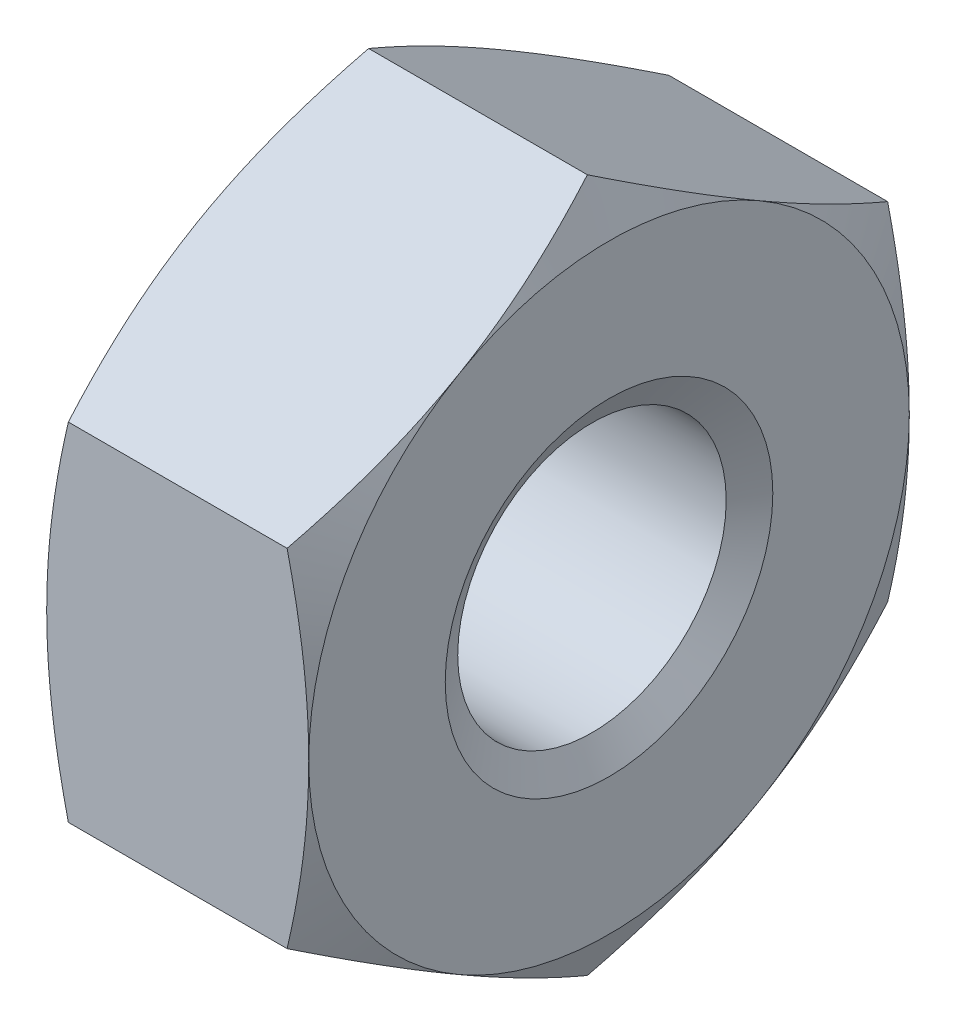
ISO-10303-21;
HEADER;
FILE_DESCRIPTION(('STEP AP214'),'2;1');
FILE_NAME('part.step','',(''),(''),'','','');
FILE_SCHEMA(('AUTOMOTIVE_DESIGN { 1 0 10303 214 1 1 1 1 }'));
ENDSEC;
DATA;
#1=APPLICATION_CONTEXT('core data for automotive mechanical design processes');
#2=APPLICATION_PROTOCOL_DEFINITION('international standard','automotive_design',2000,#1);
#3=PRODUCT_CONTEXT('',#1,'mechanical');
#4=PRODUCT('Part','Part','',(#3));
#5=PRODUCT_RELATED_PRODUCT_CATEGORY('part','',(#4));
#6=PRODUCT_DEFINITION_FORMATION('','',#4);
#7=PRODUCT_DEFINITION_CONTEXT('part definition',#1,'design');
#8=PRODUCT_DEFINITION('design','',#6,#7);
#9=PRODUCT_DEFINITION_SHAPE('','',#8);
#10=(LENGTH_UNIT() NAMED_UNIT(*) SI_UNIT(.MILLI.,.METRE.));
#11=(NAMED_UNIT(*) PLANE_ANGLE_UNIT() SI_UNIT($,.RADIAN.));
#12=(NAMED_UNIT(*) SI_UNIT($,.STERADIAN.) SOLID_ANGLE_UNIT());
#13=UNCERTAINTY_MEASURE_WITH_UNIT(LENGTH_MEASURE(1.E-05),#10,'distance_accuracy_value','');
#14=(GEOMETRIC_REPRESENTATION_CONTEXT(3) GLOBAL_UNCERTAINTY_ASSIGNED_CONTEXT((#13)) GLOBAL_UNIT_ASSIGNED_CONTEXT((#10,
#11,#12)) REPRESENTATION_CONTEXT('',''));
#15=CARTESIAN_POINT('',(0.,0.,0.));
#16=DIRECTION('',(0.,0.,1.));
#17=DIRECTION('',(1.,0.,0.));
#18=AXIS2_PLACEMENT_3D('',#15,#16,#17);
#19=CARTESIAN_POINT('',(0.,1.58771324027147,2.75));
#20=DIRECTION('',(0.,0.866025403784438,0.5));
#21=DIRECTION('',(0.,-0.5,0.866025403784438));
#22=AXIS2_PLACEMENT_3D('',#19,#20,#21);
#23=PLANE('',#22);
#24=CARTESIAN_POINT('',(2.39999999999634,2.38156986040721,1.375));
#25=CARTESIAN_POINT('',(2.40000616666126,2.41505286080661,1.31700574211839));
#26=CARTESIAN_POINT('',(2.39885876169416,2.44853294613979,1.25901653327958));
#27=CARTESIAN_POINT('',(2.39431028907632,2.5154511135919,1.14311086730311));
#28=CARTESIAN_POINT('',(2.39090948048011,2.54888920009643,1.0851944025694));
#29=CARTESIAN_POINT('',(2.37743771465737,2.64886794067353,0.912026144213097));
#30=CARTESIAN_POINT('',(2.36409667384063,2.71530386631891,0.796955745547435));
#31=CARTESIAN_POINT('',(2.32964568975427,2.84760103935437,0.567810320152289));
#32=CARTESIAN_POINT('',(2.30854135589892,2.91346266661902,0.45373463546076));
#33=CARTESIAN_POINT('',(2.25972990567875,3.04480636576855,0.226240675279734));
#34=CARTESIAN_POINT('',(2.23200076126124,3.11028640848277,0.112825914416909));
#35=CARTESIAN_POINT('',(2.20162037415845,3.17542648054468,-3.00922736737534E-12));
#36=B_SPLINE_CURVE_WITH_KNOTS('',3,(#24,#25,#26,#27,#28,#29,#30,#31,#32,#33,#34,#35),
.UNSPECIFIED.,.F.,.F.,(4,2,2,2,2,4),(0.,0.200877225607308,0.401731362085031,0.80205769301029,
1.20209533208884,1.6034821107515),.UNSPECIFIED.);
#37=CARTESIAN_POINT('',(2.39999999998499,2.38156986042828,1.37500000001216));
#38=VERTEX_POINT('',#37);
#39=CARTESIAN_POINT('',(2.20162037415832,3.17542648054497,0.));
#40=VERTEX_POINT('',#39);
#41=EDGE_CURVE('E117',#38,#40,#36,.T.);
#42=ORIENTED_EDGE('',*,*,#41,.T.);
#43=DIRECTION('',(1.,0.,0.));
#44=VECTOR('',#43,1.);
#45=CARTESIAN_POINT('',(0.,3.17542648054294,0.));
#46=LINE('',#45,#44);
#47=CARTESIAN_POINT('',(0.198379625863216,3.17542648054258,6.27754027821669E-13));
#48=VERTEX_POINT('',#47);
#49=EDGE_CURVE('E278',#48,#40,#46,.T.);
#50=ORIENTED_EDGE('',*,*,#49,.F.);
#51=CARTESIAN_POINT('',(-3.8439846141648E-12,2.38156986040721,1.375));
#52=CARTESIAN_POINT('',(-6.16666877336821E-06,2.41505286080662,1.31700574211836));
#53=CARTESIAN_POINT('',(0.00114123829850595,2.44853294613982,1.25901653327953));
#54=CARTESIAN_POINT('',(0.00568971091704368,2.51545111359195,1.14311086730303));
#55=CARTESIAN_POINT('',(0.00909051951377409,2.54888920009648,1.08519440256931));
#56=CARTESIAN_POINT('',(0.0225622853385472,2.64886794067349,0.912026144213163));
#57=CARTESIAN_POINT('',(0.0359033261572874,2.71530386631875,0.796955745547718));
#58=CARTESIAN_POINT('',(0.0703543102487479,2.84760103935379,0.567810320153296));
#59=CARTESIAN_POINT('',(0.0914586441071906,2.91346266661814,0.453734635462274));
#60=CARTESIAN_POINT('',(0.140270094334437,3.04480636576698,0.226240675282448));
#61=CARTESIAN_POINT('',(0.167999238755946,3.11028640848081,0.112825914420317));
#62=CARTESIAN_POINT('',(0.198379625863048,3.17542648054222,1.2549345155992E-12));
#63=B_SPLINE_CURVE_WITH_KNOTS('',3,(#51,#52,#53,#54,#55,#56,#57,#58,#59,#60,#61,#62),
.UNSPECIFIED.,.F.,.F.,(4,2,2,2,2,4),(0.,0.2008772256074,0.401731362085207,0.802057693010235,
1.20209533208847,1.6034821107512),.UNSPECIFIED.);
#64=CARTESIAN_POINT('',(-1.90055638725959E-11,2.38156986037905,1.37499999998374));
#65=VERTEX_POINT('',#64);
#66=EDGE_CURVE('E230',#65,#48,#63,.T.);
#67=ORIENTED_EDGE('',*,*,#66,.F.);
#68=CARTESIAN_POINT('',(0.198379604722881,1.58771328560743,2.74999992147582));
#69=CARTESIAN_POINT('',(0.167999220608511,1.65285335402833,2.6371740133623));
#70=CARTESIAN_POINT('',(0.140270079023076,1.71833339306369,2.52375925887147));
#71=CARTESIAN_POINT('',(0.0914586339082106,1.84967708480761,2.29626531151733));
#72=CARTESIAN_POINT('',(0.07035430232974,1.91553870834595,2.18218963327994));
#73=CARTESIAN_POINT('',(0.0359033220373599,2.04783587383631,1.95304422095329));
#74=CARTESIAN_POINT('',(0.0225622827361396,2.11427179566276,1.83797382890221));
#75=CARTESIAN_POINT('',(0.00909051845801585,2.21425053045946,1.66480558055787));
#76=CARTESIAN_POINT('',(0.00568971025528796,2.24768861502041,1.60688911919052));
#77=CARTESIAN_POINT('',(0.00114123816538675,2.31460677857769,1.49098345996012));
#78=CARTESIAN_POINT('',(-6.16666734820736E-06,2.3480868619596,1.432994254501));
#79=CARTESIAN_POINT('',(-3.84404576109359E-12,2.38156986040721,1.375));
#80=B_SPLINE_CURVE_WITH_KNOTS('',3,(#68,#69,#70,#71,#72,#73,#74,#75,#76,#77,#78,#79),
.UNSPECIFIED.,.F.,.F.,(4,2,2,2,2,4),(0.,0.401386755334613,0.801424371275977,1.20175067899412,
1.40260480377138,1.60348201767156),.UNSPECIFIED.);
#81=CARTESIAN_POINT('',(0.198379619760212,1.58771328209881,2.74999996073791));
#82=VERTEX_POINT('',#81);
#83=EDGE_CURVE('E121',#82,#65,#80,.T.);
#84=ORIENTED_EDGE('',*,*,#83,.F.);
#85=DIRECTION('',(1.,0.,0.));
#86=VECTOR('',#85,1.);
#87=CARTESIAN_POINT('',(0.,1.58771324027147,2.75));
#88=LINE('',#87,#86);
#89=CARTESIAN_POINT('',(2.20162037415879,1.58771324027045,2.75000000000176));
#90=VERTEX_POINT('',#89);
#91=EDGE_CURVE('E119',#90,#82,#88,.F.);
#92=ORIENTED_EDGE('',*,*,#91,.F.);
#93=CARTESIAN_POINT('',(2.20162037415581,1.58771324026646,2.75000000000112));
#94=CARTESIAN_POINT('',(2.23200076126024,1.65285331233033,2.63717408558265));
#95=CARTESIAN_POINT('',(2.25972990567843,1.71833335504538,2.52375932472038));
#96=CARTESIAN_POINT('',(2.30854135589912,1.84967705419555,2.2962653645397));
#97=CARTESIAN_POINT('',(2.3296456897543,1.91553868146001,2.18218967984796));
#98=CARTESIAN_POINT('',(2.36409667384055,2.04783585449535,1.95304425445264));
#99=CARTESIAN_POINT('',(2.37743771465735,2.11427178014079,1.83797385578701));
#100=CARTESIAN_POINT('',(2.39090948048011,2.21425052071794,1.6648055974307));
#101=CARTESIAN_POINT('',(2.39431028907632,2.24768860722247,1.60688913269696));
#102=CARTESIAN_POINT('',(2.39885876169416,2.3146067746746,1.49098346672045));
#103=CARTESIAN_POINT('',(2.40000616666126,2.34808686000779,1.43299425788162));
#104=CARTESIAN_POINT('',(2.39999999999634,2.38156986040721,1.375));
#105=B_SPLINE_CURVE_WITH_KNOTS('',3,(#93,#94,#95,#96,#97,#98,#99,#100,#101,#102,#103,#104),
.UNSPECIFIED.,.F.,.F.,(4,2,2,2,2,4),(0.,0.401386778662882,0.801424417741586,1.2017507486669,
1.40260488514468,1.60348211075205),.UNSPECIFIED.);
#106=EDGE_CURVE('E20',#90,#38,#105,.T.);
#107=ORIENTED_EDGE('',*,*,#106,.T.);
#108=EDGE_LOOP('',(#42,#50,#67,#84,#92,#107));
#109=FACE_BOUND('',#108,.T.);
#110=ADVANCED_FACE('F16',(#109),#23,.T.);
#111=CARTESIAN_POINT('',(0.199569903543306,0.,0.));
#112=DIRECTION('',(1.,0.,0.));
#113=DIRECTION('',(0.,0.,-1.));
#114=AXIS2_PLACEMENT_3D('',#111,#112,#113);
#115=CONICAL_SURFACE('',#114,3.17797903926476,1.13446401378062);
#116=CARTESIAN_POINT('',(0.198379660847089,-1.5877131901468,-2.75000000829416));
#117=CARTESIAN_POINT('',(0.167999255622693,-1.65285328392067,-2.63717410667714));
#118=CARTESIAN_POINT('',(0.140270103098649,-1.71833333650226,-2.52375934932648));
#119=CARTESIAN_POINT('',(0.0914586457063207,-1.84967704487467,-2.2962653881702));
#120=CARTESIAN_POINT('',(0.0703543127440415,-1.91553867152865,-2.18218969902053));
#121=CARTESIAN_POINT('',(0.0359033284558591,-2.04783584602182,-1.95304426715684));
#122=CARTESIAN_POINT('',(0.0225622865219637,-2.11427177373622,-1.83797386648476));
#123=CARTESIAN_POINT('',(0.00909051988285709,-2.21425051678403,-1.66480560444275));
#124=CARTESIAN_POINT('',(0.00568971115820027,-2.2476886040353,-1.60688913831648));
#125=CARTESIAN_POINT('',(0.00114123838707001,-2.31460677300807,-1.49098346950778));
#126=CARTESIAN_POINT('',(-6.16660321985836E-06,-2.3480868591152,-1.43299425922925));
#127=CARTESIAN_POINT('',(-3.84501560645457E-12,-2.3815698604072,-1.375));
#128=B_SPLINE_CURVE_WITH_KNOTS('',3,(#116,#117,#118,#119,#120,#121,#122,#123,#124,#125,#126,
#127),.UNSPECIFIED.,.F.,.F.,(4,2,2,2,2,4),(0.,0.401386789209229,0.801424438115318,
1.20175077780516,1.40260491901622,1.6034821495039),.UNSPECIFIED.);
#129=CARTESIAN_POINT('',(0.198379630330477,-1.58771323069175,-2.75000001659255));
#130=VERTEX_POINT('',#129);
#131=CARTESIAN_POINT('',(-1.900605413983E-11,-2.38156986037905,-1.37499999998374));
#132=VERTEX_POINT('',#131);
#133=EDGE_CURVE('E190',#130,#132,#128,.T.);
#134=ORIENTED_EDGE('',*,*,#133,.T.);
#135=CARTESIAN_POINT('',(-3.41670593727306E-11,0.,0.));
#136=DIRECTION('',(1.,0.,0.));
#137=DIRECTION('',(0.,0.,-1.));
#138=AXIS2_PLACEMENT_3D('',#135,#136,#137);
#139=CIRCLE('',#138,2.74999999993497);
#140=CARTESIAN_POINT('',(-1.90046152866183E-11,0.,-2.74999999996749));
#141=VERTEX_POINT('',#140);
#142=EDGE_CURVE('E126',#132,#141,#139,.T.);
#143=ORIENTED_EDGE('',*,*,#142,.T.);
#144=CARTESIAN_POINT('',(-3.84218292791187E-12,0.,-2.75));
#145=CARTESIAN_POINT('',(-6.16666734649812E-06,-0.066965996895157,-2.75));
#146=CARTESIAN_POINT('',(0.00114123816538682,-0.13392616365894,-2.75));
#147=CARTESIAN_POINT('',(0.00568971025528174,-0.267762490773398,-2.75));
#148=CARTESIAN_POINT('',(0.00909051845800499,-0.334638659895246,-2.75));
#149=CARTESIAN_POINT('',(0.0225622827361103,-0.534596129488507,-2.75));
#150=CARTESIAN_POINT('',(0.0359033220373122,-0.66746797314131,-2.75));
#151=CARTESIAN_POINT('',(0.0703543023296462,-0.932062304121845,-2.75000000000001));
#152=CARTESIAN_POINT('',(0.091458633908089,-1.06378555119845,-2.75000000000001));
#153=CARTESIAN_POINT('',(0.140270079022892,-1.32647293468611,-2.75000000000001));
#154=CARTESIAN_POINT('',(0.167999220608293,-1.45743301275673,-2.75000000000001));
#155=CARTESIAN_POINT('',(0.198379604722626,-1.58771314959845,-2.75000000000001));
#156=B_SPLINE_CURVE_WITH_KNOTS('',3,(#144,#145,#146,#147,#148,#149,#150,#151,#152,#153,#154,
#155),.UNSPECIFIED.,.F.,.F.,(4,2,2,2,2,4),(0.,0.200877213900039,0.401731338677161,
0.802057646395017,1.2020952623361,1.60348201767043),.UNSPECIFIED.);
#157=EDGE_CURVE('E182',#141,#130,#156,.T.);
#158=ORIENTED_EDGE('',*,*,#157,.T.);
#159=EDGE_LOOP('',(#134,#143,#158));
#160=FACE_BOUND('',#159,.T.);
#161=ADVANCED_FACE('F196',(#160),#115,.T.);
#162=CARTESIAN_POINT('',(0.199569903543306,0.,0.));
#163=DIRECTION('',(1.,0.,0.));
#164=DIRECTION('',(0.,0.,-1.));
#165=AXIS2_PLACEMENT_3D('',#162,#163,#164);
#166=CONICAL_SURFACE('',#165,3.17797903926476,1.13446401378062);
#167=CARTESIAN_POINT('',(0.198379625863049,1.58771324027003,-2.75));
#168=CARTESIAN_POINT('',(0.167999238755947,1.45743309614721,-2.75));
#169=CARTESIAN_POINT('',(0.140270094334438,1.32647301071955,-2.75));
#170=CARTESIAN_POINT('',(0.0914586441071916,1.06378561242187,-2.75));
#171=CARTESIAN_POINT('',(0.0703543102487489,0.93206235789317,-2.75));
#172=CARTESIAN_POINT('',(0.0359033261572886,0.667468011823088,-2.75));
#173=CARTESIAN_POINT('',(0.0225622853385488,0.534596160532582,-2.75));
#174=CARTESIAN_POINT('',(0.00909051951377568,0.334638679378546,-2.75));
#175=CARTESIAN_POINT('',(0.00568971091704521,0.267762506369494,-2.75));
#176=CARTESIAN_POINT('',(0.00114123829850748,0.133926171465226,-2.75));
#177=CARTESIAN_POINT('',(-6.16666877179577E-06,0.0669660007988331,-2.75));
#178=CARTESIAN_POINT('',(-3.84219088133817E-12,0.,-2.75));
#179=B_SPLINE_CURVE_WITH_KNOTS('',3,(#167,#168,#169,#170,#171,#172,#173,#174,#175,#176,#177,
#178),.UNSPECIFIED.,.F.,.F.,(4,2,2,2,2,4),(0.,0.401386778662738,0.801424417740972,
1.201750748666,1.40260488514381,1.60348211075121),.UNSPECIFIED.);
#180=CARTESIAN_POINT('',(0.198379625863048,1.58771324027111,-2.74999999999937));
#181=VERTEX_POINT('',#180);
#182=EDGE_CURVE('E223',#181,#141,#179,.T.);
#183=ORIENTED_EDGE('',*,*,#182,.T.);
#184=CARTESIAN_POINT('',(-3.41672762131651E-11,0.,0.));
#185=DIRECTION('',(1.,0.,0.));
#186=DIRECTION('',(0.,0.,-1.));
#187=AXIS2_PLACEMENT_3D('',#184,#185,#186);
#188=CIRCLE('',#187,2.74999999993497);
#189=CARTESIAN_POINT('',(-1.90056840234017E-11,2.38156986037905,-1.37499999998374));
#190=VERTEX_POINT('',#189);
#191=EDGE_CURVE('E460',#141,#190,#188,.T.);
#192=ORIENTED_EDGE('',*,*,#191,.T.);
#193=CARTESIAN_POINT('',(0.198379625863047,1.5877132402722,-2.74999999999874));
#194=CARTESIAN_POINT('',(0.167999238755945,1.65285331233361,-2.63717408557968));
#195=CARTESIAN_POINT('',(0.140270094334436,1.71833335504744,-2.52375932471755));
#196=CARTESIAN_POINT('',(0.0914586441071897,1.84967705419627,-2.29626536453772));
#197=CARTESIAN_POINT('',(0.0703543102487468,1.91553868146063,-2.1821896798467));
#198=CARTESIAN_POINT('',(0.0359033261572866,2.04783585449567,-1.95304425445228));
#199=CARTESIAN_POINT('',(0.022562285338547,2.11427178014092,-1.83797385578683));
#200=CARTESIAN_POINT('',(0.00909051951377384,2.21425052071794,-1.66480559743069));
#201=CARTESIAN_POINT('',(0.0056897109170433,2.24768860722246,-1.60688913269697));
#202=CARTESIAN_POINT('',(0.00114123829850548,2.3146067746746,-1.49098346672047));
#203=CARTESIAN_POINT('',(-6.16666877379981E-06,2.34808686000779,-1.43299425788163));
#204=CARTESIAN_POINT('',(-3.84409626125703E-12,2.38156986040721,-1.375));
#205=B_SPLINE_CURVE_WITH_KNOTS('',3,(#193,#194,#195,#196,#197,#198,#199,#200,#201,#202,#203,
#204),.UNSPECIFIED.,.F.,.F.,(4,2,2,2,2,4),(0.,0.401386778662737,0.801424417740969,
1.201750748666,1.4026048851438,1.6034821107512),.UNSPECIFIED.);
#206=EDGE_CURVE('E245',#181,#190,#205,.T.);
#207=ORIENTED_EDGE('',*,*,#206,.F.);
#208=EDGE_LOOP('',(#183,#192,#207));
#209=FACE_BOUND('',#208,.T.);
#210=ADVANCED_FACE('F236',(#209),#166,.T.);
#211=CARTESIAN_POINT('',(0.199569903543306,0.,0.));
#212=DIRECTION('',(1.,0.,0.));
#213=DIRECTION('',(0.,0.,-1.));
#214=AXIS2_PLACEMENT_3D('',#211,#212,#213);
#215=CONICAL_SURFACE('',#214,3.17797903926476,1.13446401378062);
#216=CARTESIAN_POINT('',(-3.41672762131651E-11,0.,0.));
#217=DIRECTION('',(1.,0.,0.));
#218=DIRECTION('',(0.,0.,-1.));
#219=AXIS2_PLACEMENT_3D('',#216,#217,#218);
#220=CIRCLE('',#219,2.74999999993497);
#221=EDGE_CURVE('E452',#190,#65,#220,.T.);
#222=ORIENTED_EDGE('',*,*,#221,.T.);
#223=ORIENTED_EDGE('',*,*,#66,.T.);
#224=CARTESIAN_POINT('',(-3.84409769734129E-12,2.38156986040721,-1.375));
#225=CARTESIAN_POINT('',(-6.16666877365785E-06,2.41505286080662,-1.31700574211836));
#226=CARTESIAN_POINT('',(0.00114123829850558,2.44853294613982,-1.25901653327953));
#227=CARTESIAN_POINT('',(0.00568971091704324,2.51545111359195,-1.14311086730303));
#228=CARTESIAN_POINT('',(0.00909051951377366,2.54888920009648,-1.08519440256931));
#229=CARTESIAN_POINT('',(0.0225622853385467,2.64886794067349,-0.912026144213163));
#230=CARTESIAN_POINT('',(0.0359033261572866,2.71530386631875,-0.796955745547717));
#231=CARTESIAN_POINT('',(0.0703543102487469,2.84760103935379,-0.567810320153294));
#232=CARTESIAN_POINT('',(0.0914586441071894,2.91346266661814,-0.453734635462273));
#233=CARTESIAN_POINT('',(0.140270094334435,3.04480636576698,-0.226240675282446));
#234=CARTESIAN_POINT('',(0.167999238755945,3.1102864084808,-0.112825914420315));
#235=CARTESIAN_POINT('',(0.198379625863047,3.17542648054222,-1.25254808413164E-12));
#236=B_SPLINE_CURVE_WITH_KNOTS('',3,(#224,#225,#226,#227,#228,#229,#230,#231,#232,#233,#234,
#235),.UNSPECIFIED.,.F.,.F.,(4,2,2,2,2,4),(0.,0.2008772256074,0.401731362085207,
0.802057693010236,1.20209533208847,1.60348211075121),.UNSPECIFIED.);
#237=EDGE_CURVE('E271',#190,#48,#236,.T.);
#238=ORIENTED_EDGE('',*,*,#237,.F.);
#239=EDGE_LOOP('',(#222,#223,#238));
#240=FACE_BOUND('',#239,.T.);
#241=ADVANCED_FACE('F239',(#240),#215,.T.);
#242=CARTESIAN_POINT('',(0.199569903543306,0.,0.));
#243=DIRECTION('',(1.,0.,0.));
#244=DIRECTION('',(0.,0.,-1.));
#245=AXIS2_PLACEMENT_3D('',#242,#243,#244);
#246=CONICAL_SURFACE('',#245,3.17797903926476,1.13446401378062);
#247=CARTESIAN_POINT('',(-3.41672762131651E-11,0.,0.));
#248=DIRECTION('',(1.,0.,0.));
#249=DIRECTION('',(0.,0.,-1.));
#250=AXIS2_PLACEMENT_3D('',#247,#248,#249);
#251=CIRCLE('',#250,2.74999999993497);
#252=CARTESIAN_POINT('',(-1.90055856967699E-11,0.,2.74999999996749));
#253=VERTEX_POINT('',#252);
#254=EDGE_CURVE('E466',#65,#253,#251,.T.);
#255=ORIENTED_EDGE('',*,*,#254,.T.);
#256=CARTESIAN_POINT('',(0.198379634797543,1.5877132785902,2.75));
#257=CARTESIAN_POINT('',(0.167999246425619,1.45743313139019,2.75));
#258=CARTESIAN_POINT('',(0.140270100805496,1.32647304285326,2.75));
#259=CARTESIAN_POINT('',(0.091458648417598,1.06378563829649,2.75));
#260=CARTESIAN_POINT('',(0.0703543135955678,0.932062380618329,2.75));
#261=CARTESIAN_POINT('',(0.0359033278984971,0.667468028171009,2.75));
#262=CARTESIAN_POINT('',(0.0225622864384056,0.534596173652611,2.75));
#263=CARTESIAN_POINT('',(0.00909051995997032,0.33463868761269,2.75));
#264=CARTESIAN_POINT('',(0.0056897111967222,0.267762512960804,2.75));
#265=CARTESIAN_POINT('',(0.00114123835476629,0.133926174764359,2.75));
#266=CARTESIAN_POINT('',(-6.16666937561711E-06,0.0669660024486209,2.75));
#267=CARTESIAN_POINT('',(-3.84386488891353E-12,0.,2.75));
#268=B_SPLINE_CURVE_WITH_KNOTS('',3,(#256,#257,#258,#259,#260,#261,#262,#263,#264,#265,#266,
#267),.UNSPECIFIED.,.F.,.F.,(4,2,2,2,2,4),(0.,0.401386788521933,0.801424437378531,
1.20175077811152,1.40260491953434,1.60348215008958),.UNSPECIFIED.);
#269=EDGE_CURVE('E252',#82,#253,#268,.T.);
#270=ORIENTED_EDGE('',*,*,#269,.F.);
#271=ORIENTED_EDGE('',*,*,#83,.T.);
#272=EDGE_LOOP('',(#255,#270,#271));
#273=FACE_BOUND('',#272,.T.);
#274=ADVANCED_FACE('F432',(#273),#246,.T.);
#275=CARTESIAN_POINT('',(0.199569903543306,0.,0.));
#276=DIRECTION('',(1.,0.,0.));
#277=DIRECTION('',(0.,0.,-1.));
#278=AXIS2_PLACEMENT_3D('',#275,#276,#277);
#279=CONICAL_SURFACE('',#278,3.17797903926476,1.13446401378062);
#280=CARTESIAN_POINT('',(-3.41672762131651E-11,0.,0.));
#281=DIRECTION('',(1.,0.,0.));
#282=DIRECTION('',(0.,0.,-1.));
#283=AXIS2_PLACEMENT_3D('',#280,#281,#282);
#284=CIRCLE('',#283,2.74999999993497);
#285=CARTESIAN_POINT('',(-1.90056600251372E-11,-2.38156986037905,1.37499999998374));
#286=VERTEX_POINT('',#285);
#287=EDGE_CURVE('E472',#253,#286,#284,.T.);
#288=ORIENTED_EDGE('',*,*,#287,.T.);
#289=CARTESIAN_POINT('',(-3.84403797340651E-12,-2.38156986040721,1.375));
#290=CARTESIAN_POINT('',(-6.16666877348664E-06,-2.34808686000779,1.43299425788163));
#291=CARTESIAN_POINT('',(0.00114123829850581,-2.3146067746746,1.49098346672047));
#292=CARTESIAN_POINT('',(0.0056897109170435,-2.24768860722246,1.60688913269697));
#293=CARTESIAN_POINT('',(0.00909051951377391,-2.21425052071794,1.66480559743069));
#294=CARTESIAN_POINT('',(0.0225622853385469,-2.11427178014092,1.83797385578683));
#295=CARTESIAN_POINT('',(0.0359033261572869,-2.04783585449566,1.95304425445228));
#296=CARTESIAN_POINT('',(0.0703543102487474,-1.91553868146062,2.1821896798467));
#297=CARTESIAN_POINT('',(0.0914586441071901,-1.84967705419627,2.29626536453773));
#298=CARTESIAN_POINT('',(0.140270094334436,-1.71833335504743,2.52375932471755));
#299=CARTESIAN_POINT('',(0.167999238755946,-1.65285331233361,2.63717408557968));
#300=CARTESIAN_POINT('',(0.198379625863048,-1.58771324027219,2.74999999999875));
#301=B_SPLINE_CURVE_WITH_KNOTS('',3,(#289,#290,#291,#292,#293,#294,#295,#296,#297,#298,#299,
#300),.UNSPECIFIED.,.F.,.F.,(4,2,2,2,2,4),(0.,0.2008772256074,0.401731362085208,
0.802057693010238,1.20209533208847,1.60348211075121),.UNSPECIFIED.);
#302=CARTESIAN_POINT('',(0.198379625863048,-1.58771324027111,2.74999999999937));
#303=VERTEX_POINT('',#302);
#304=EDGE_CURVE('E435',#286,#303,#301,.T.);
#305=ORIENTED_EDGE('',*,*,#304,.T.);
#306=CARTESIAN_POINT('',(-3.84391336008742E-12,0.,2.75));
#307=CARTESIAN_POINT('',(-6.16666877344378E-06,-0.0669660007988285,2.75));
#308=CARTESIAN_POINT('',(0.00114123829850585,-0.133926171465221,2.75));
#309=CARTESIAN_POINT('',(0.00568971091704358,-0.267762506369489,2.75));
#310=CARTESIAN_POINT('',(0.00909051951377404,-0.334638679378542,2.75));
#311=CARTESIAN_POINT('',(0.0225622853385471,-0.534596160532577,2.75));
#312=CARTESIAN_POINT('',(0.0359033261572869,-0.667468011823082,2.75));
#313=CARTESIAN_POINT('',(0.0703543102487473,-0.932062357893164,2.75));
#314=CARTESIAN_POINT('',(0.0914586441071901,-1.06378561242187,2.75));
#315=CARTESIAN_POINT('',(0.140270094334436,-1.32647301071954,2.75));
#316=CARTESIAN_POINT('',(0.167999238755946,-1.4574330961472,2.75));
#317=CARTESIAN_POINT('',(0.198379625863047,-1.58771324027002,2.75));
#318=B_SPLINE_CURVE_WITH_KNOTS('',3,(#306,#307,#308,#309,#310,#311,#312,#313,#314,#315,#316,
#317),.UNSPECIFIED.,.F.,.F.,(4,2,2,2,2,4),(0.,0.2008772256074,0.401731362085207,
0.802057693010236,1.20209533208847,1.60348211075121),.UNSPECIFIED.);
#319=EDGE_CURVE('E138',#253,#303,#318,.T.);
#320=ORIENTED_EDGE('',*,*,#319,.F.);
#321=EDGE_LOOP('',(#288,#305,#320));
#322=FACE_BOUND('',#321,.T.);
#323=ADVANCED_FACE('F429',(#322),#279,.T.);
#324=CARTESIAN_POINT('',(0.199569903543306,0.,0.));
#325=DIRECTION('',(1.,0.,0.));
#326=DIRECTION('',(0.,0.,-1.));
#327=AXIS2_PLACEMENT_3D('',#324,#325,#326);
#328=CONICAL_SURFACE('',#327,3.17797903926476,1.13446401378062);
#329=CARTESIAN_POINT('',(-3.41670593727306E-11,0.,0.));
#330=DIRECTION('',(1.,0.,0.));
#331=DIRECTION('',(0.,0.,-1.));
#332=AXIS2_PLACEMENT_3D('',#329,#330,#331);
#333=CIRCLE('',#332,2.74999999993497);
#334=EDGE_CURVE('E372',#286,#132,#333,.T.);
#335=ORIENTED_EDGE('',*,*,#334,.T.);
#336=CARTESIAN_POINT('',(-3.84496488167588E-12,-2.3815698604072,-1.375));
#337=CARTESIAN_POINT('',(-6.16666928135463E-06,-2.41505286150076,-1.31700574091607));
#338=CARTESIAN_POINT('',(0.00114123834584747,-2.44853294752791,-1.25901653087527));
#339=CARTESIAN_POINT('',(0.00568971115239018,-2.51545111636522,-1.14311086249958));
#340=CARTESIAN_POINT('',(0.00909051988924419,-2.54888920356096,-1.08519439656864));
#341=CARTESIAN_POINT('',(0.0225622862640696,-2.6488679461937,-0.912026134651884));
#342=CARTESIAN_POINT('',(0.0359033276225022,-2.71530387319708,-0.796955733634097));
#343=CARTESIAN_POINT('',(0.0703543130650725,-2.84760104891532,-0.567810303592235));
#344=CARTESIAN_POINT('',(0.0914586477343675,-2.91346267750479,-0.453734616606036));
#345=CARTESIAN_POINT('',(0.140270099779787,-3.04480637928712,-0.226240651864865));
#346=CARTESIAN_POINT('',(0.167999245209922,-3.11028642330917,-0.112825888736834));
#347=CARTESIAN_POINT('',(0.198379633381363,-3.1754264966653,2.79247392353729E-08));
#348=B_SPLINE_CURVE_WITH_KNOTS('',3,(#336,#337,#338,#339,#340,#341,#342,#343,#344,#345,#346,
#347),.UNSPECIFIED.,.F.,.F.,(4,2,2,2,2,4),(0.,0.20087722977097,0.401731370409974,
0.802057709588332,1.20209535689499,1.60348214385417),.UNSPECIFIED.);
#349=CARTESIAN_POINT('',(0.198379615293075,-3.17542645787484,3.92623094649061E-08));
#350=VERTEX_POINT('',#349);
#351=EDGE_CURVE('E279',#132,#350,#348,.T.);
#352=ORIENTED_EDGE('',*,*,#351,.T.);
#353=CARTESIAN_POINT('',(0.198379604722764,-3.17542643520673,7.85246181011357E-08));
#354=CARTESIAN_POINT('',(0.167999220608411,-3.11028636678585,0.112825986638104));
#355=CARTESIAN_POINT('',(0.140270079022991,-3.04480632775051,0.226240741128894));
#356=CARTESIAN_POINT('',(0.0914586339081542,-2.91346263600663,0.45373468848296));
#357=CARTESIAN_POINT('',(0.0703543023296963,-2.84760101246831,0.567810366720313));
#358=CARTESIAN_POINT('',(0.0359033220373373,-2.71530384697799,0.79695577904689));
#359=CARTESIAN_POINT('',(0.0225622827361255,-2.64886792515156,0.912026171097935));
#360=CARTESIAN_POINT('',(0.00909051845801012,-2.5488891903549,1.08519441944222));
#361=CARTESIAN_POINT('',(0.00568971025528428,-2.51545110579396,1.14311088080955));
#362=CARTESIAN_POINT('',(0.00114123816538585,-2.4485329422367,1.25901654003992));
#363=CARTESIAN_POINT('',(-6.16666734838046E-06,-2.4150528588548,1.31700574549902));
#364=CARTESIAN_POINT('',(-3.84408147618991E-12,-2.38156986040721,1.375));
#365=B_SPLINE_CURVE_WITH_KNOTS('',3,(#353,#354,#355,#356,#357,#358,#359,#360,#361,#362,#363,
#364),.UNSPECIFIED.,.F.,.F.,(4,2,2,2,2,4),(0.,0.401386755334483,0.801424371275717,
1.20175067899373,1.40260480377093,1.60348201767104),.UNSPECIFIED.);
#366=EDGE_CURVE('E286',#350,#286,#365,.T.);
#367=ORIENTED_EDGE('',*,*,#366,.T.);
#368=EDGE_LOOP('',(#335,#352,#367));
#369=FACE_BOUND('',#368,.T.);
#370=ADVANCED_FACE('F264',(#369),#328,.T.);
#371=CARTESIAN_POINT('',(0.,3.17542648054294,0.));
#372=DIRECTION('',(0.,0.866025403784439,-0.499999999999999));
#373=DIRECTION('',(0.,0.499999999999999,0.866025403784439));
#374=AXIS2_PLACEMENT_3D('',#371,#372,#373);
#375=PLANE('',#374);
#376=DIRECTION('',(1.,0.,0.));
#377=VECTOR('',#376,1.);
#378=CARTESIAN_POINT('',(0.,1.58771324027148,-2.75));
#379=LINE('',#378,#377);
#380=CARTESIAN_POINT('',(2.20162037415832,1.58771324027249,-2.75000000000176));
#381=VERTEX_POINT('',#380);
#382=EDGE_CURVE('E369',#181,#381,#379,.T.);
#383=ORIENTED_EDGE('',*,*,#382,.F.);
#384=ORIENTED_EDGE('',*,*,#206,.T.);
#385=ORIENTED_EDGE('',*,*,#237,.T.);
#386=ORIENTED_EDGE('',*,*,#49,.T.);
#387=CARTESIAN_POINT('',(2.20162037415581,3.17542648054141,4.89912815416859E-12));
#388=CARTESIAN_POINT('',(2.23200076126024,3.11028640848174,-0.112825914415996));
#389=CARTESIAN_POINT('',(2.25972990567844,3.0448063657684,-0.226240675279256));
#390=CARTESIAN_POINT('',(2.30854135589912,2.91346266661949,-0.453734635460659));
#391=CARTESIAN_POINT('',(2.3296456897543,2.84760103935457,-0.567810320152131));
#392=CARTESIAN_POINT('',(2.36409667384055,2.7153038663189,-0.796955745547263));
#393=CARTESIAN_POINT('',(2.37743771465735,2.64886794067358,-0.912026144212968));
#394=CARTESIAN_POINT('',(2.39090948048011,2.54888920009649,-1.08519440256931));
#395=CARTESIAN_POINT('',(2.39431028907632,2.51545111359195,-1.14311086730304));
#396=CARTESIAN_POINT('',(2.39885876169416,2.4485329461398,-1.25901653327954));
#397=CARTESIAN_POINT('',(2.40000616666126,2.41505286080661,-1.31700574211837));
#398=CARTESIAN_POINT('',(2.39999999999634,2.38156986040721,-1.375));
#399=B_SPLINE_CURVE_WITH_KNOTS('',3,(#387,#388,#389,#390,#391,#392,#393,#394,#395,#396,#397,
#398),.UNSPECIFIED.,.F.,.F.,(4,2,2,2,2,4),(0.,0.401386778662881,0.801424417741584,
1.20175074866689,1.40260488514467,1.60348211075205),.UNSPECIFIED.);
#400=CARTESIAN_POINT('',(2.39999999998499,2.38156986042828,-1.37500000001216));
#401=VERTEX_POINT('',#400);
#402=EDGE_CURVE('E171',#40,#401,#399,.T.);
#403=ORIENTED_EDGE('',*,*,#402,.T.);
#404=CARTESIAN_POINT('',(2.39999999999634,2.38156986040721,-1.375));
#405=CARTESIAN_POINT('',(2.40000616666126,2.34808686000781,-1.4329942578816));
#406=CARTESIAN_POINT('',(2.39885876169416,2.31460677467463,-1.49098346672042));
#407=CARTESIAN_POINT('',(2.39431028907632,2.24768860722251,-1.60688913269688));
#408=CARTESIAN_POINT('',(2.39090948048011,2.21425052071799,-1.6648055974306));
#409=CARTESIAN_POINT('',(2.37743771465737,2.11427178014088,-1.8379738557869));
#410=CARTESIAN_POINT('',(2.36409667384063,2.0478358544955,-1.95304425445256));
#411=CARTESIAN_POINT('',(2.32964568975427,1.91553868146004,-2.18218967984771));
#412=CARTESIAN_POINT('',(2.30854135589892,1.8496770541954,-2.29626536453924));
#413=CARTESIAN_POINT('',(2.25972990567875,1.71833335504587,-2.52375932472026));
#414=CARTESIAN_POINT('',(2.23200076126124,1.65285331233164,-2.63717408558309));
#415=CARTESIAN_POINT('',(2.20162037415845,1.58771324026973,-2.75000000000301));
#416=B_SPLINE_CURVE_WITH_KNOTS('',3,(#404,#405,#406,#407,#408,#409,#410,#411,#412,#413,#414,
#415),.UNSPECIFIED.,.F.,.F.,(4,2,2,2,2,4),(0.,0.200877225607308,0.401731362085032,
0.802057693010291,1.20209533208884,1.60348211075151),.UNSPECIFIED.);
#417=EDGE_CURVE('E253',#401,#381,#416,.T.);
#418=ORIENTED_EDGE('',*,*,#417,.T.);
#419=EDGE_LOOP('',(#383,#384,#385,#386,#403,#418));
#420=FACE_BOUND('',#419,.T.);
#421=ADVANCED_FACE('F260',(#420),#375,.T.);
#422=CARTESIAN_POINT('',(0.,-1.58771324027147,2.75));
#423=DIRECTION('',(0.,0.,1.));
#424=DIRECTION('',(1.,0.,0.));
#425=AXIS2_PLACEMENT_3D('',#422,#423,#424);
#426=PLANE('',#425);
#427=CARTESIAN_POINT('',(2.39999999999634,0.,2.75));
#428=CARTESIAN_POINT('',(2.40000616666126,0.0669660007987959,2.75));
#429=CARTESIAN_POINT('',(2.39885876169416,0.133926171465158,2.75));
#430=CARTESIAN_POINT('',(2.39431028907632,0.267762506369389,2.75));
#431=CARTESIAN_POINT('',(2.39090948048011,0.334638679378437,2.75));
#432=CARTESIAN_POINT('',(2.37743771465737,0.534596160532653,2.75));
#433=CARTESIAN_POINT('',(2.36409667384063,0.667468011823409,2.75));
#434=CARTESIAN_POINT('',(2.32964568975427,0.932062357894327,2.75));
#435=CARTESIAN_POINT('',(2.30854135589892,1.06378561242362,2.75));
#436=CARTESIAN_POINT('',(2.25972990567875,1.32647301072268,2.75));
#437=CARTESIAN_POINT('',(2.23200076126124,1.45743309615114,2.75));
#438=CARTESIAN_POINT('',(2.20162037415845,1.58771324027495,2.75));
#439=B_SPLINE_CURVE_WITH_KNOTS('',3,(#427,#428,#429,#430,#431,#432,#433,#434,#435,#436,#437,
#438),.UNSPECIFIED.,.F.,.F.,(4,2,2,2,2,4),(0.,0.200877225607308,0.401731362085032,
0.802057693010291,1.20209533208884,1.60348211075151),.UNSPECIFIED.);
#440=CARTESIAN_POINT('',(2.39999999998499,0.,2.75000000002433));
#441=VERTEX_POINT('',#440);
#442=EDGE_CURVE('E112',#441,#90,#439,.T.);
#443=ORIENTED_EDGE('',*,*,#442,.T.);
#444=ORIENTED_EDGE('',*,*,#91,.T.);
#445=ORIENTED_EDGE('',*,*,#269,.T.);
#446=ORIENTED_EDGE('',*,*,#319,.T.);
#447=DIRECTION('',(1.,0.,0.));
#448=VECTOR('',#447,1.);
#449=CARTESIAN_POINT('',(0.,-1.58771324027147,2.75));
#450=LINE('',#449,#448);
#451=CARTESIAN_POINT('',(2.20162037415879,-1.5877132402735,2.75));
#452=VERTEX_POINT('',#451);
#453=EDGE_CURVE('E355',#452,#303,#450,.F.);
#454=ORIENTED_EDGE('',*,*,#453,.F.);
#455=CARTESIAN_POINT('',(2.20162037415581,-1.58771324027495,2.74999999999623));
#456=CARTESIAN_POINT('',(2.23200076126024,-1.45743309615141,2.74999999999865));
#457=CARTESIAN_POINT('',(2.25972990567843,-1.32647301072302,2.74999999999964));
#458=CARTESIAN_POINT('',(2.30854135589912,-1.06378561242394,2.75000000000036));
#459=CARTESIAN_POINT('',(2.3296456897543,-0.932062357894563,2.75000000000009));
#460=CARTESIAN_POINT('',(2.36409667384055,-0.667468011823552,2.7499999999999));
#461=CARTESIAN_POINT('',(2.37743771465735,-0.534596160532791,2.74999999999998));
#462=CARTESIAN_POINT('',(2.39090948048011,-0.334638679378544,2.75000000000001));
#463=CARTESIAN_POINT('',(2.39431028907632,-0.267762506369478,2.75));
#464=CARTESIAN_POINT('',(2.39885876169416,-0.133926171465204,2.75));
#465=CARTESIAN_POINT('',(2.40000616666126,-0.0669660007988181,2.74999999999999));
#466=CARTESIAN_POINT('',(2.39999999999634,0.,2.75));
#467=B_SPLINE_CURVE_WITH_KNOTS('',3,(#455,#456,#457,#458,#459,#460,#461,#462,#463,#464,#465,
#466),.UNSPECIFIED.,.F.,.F.,(4,2,2,2,2,4),(0.,0.401386778662881,0.801424417741584,
1.20175074866689,1.40260488514467,1.60348211075205),.UNSPECIFIED.);
#468=EDGE_CURVE('E131',#452,#441,#467,.T.);
#469=ORIENTED_EDGE('',*,*,#468,.T.);
#470=EDGE_LOOP('',(#443,#444,#445,#446,#454,#469));
#471=FACE_BOUND('',#470,.T.);
#472=ADVANCED_FACE('F129',(#471),#426,.T.);
#473=CARTESIAN_POINT('',(0.,0.,0.));
#474=DIRECTION('',(1.,0.,0.));
#475=DIRECTION('',(0.,0.,-1.));
#476=AXIS2_PLACEMENT_3D('',#473,#474,#475);
#477=PLANE('',#476);
#478=CARTESIAN_POINT('',(0.,0.,0.));
#479=DIRECTION('',(-1.,0.,0.));
#480=DIRECTION('',(0.,0.,1.));
#481=AXIS2_PLACEMENT_3D('',#478,#479,#480);
#482=CIRCLE('',#481,1.50013293870188);
#483=CARTESIAN_POINT('',(0.,0.,1.50013293870188));
#484=VERTEX_POINT('',#483);
#485=EDGE_CURVE('E313',#484,#484,#482,.F.);
#486=ORIENTED_EDGE('',*,*,#485,.T.);
#487=EDGE_LOOP('',(#486));
#488=FACE_BOUND('',#487,.T.);
#489=ORIENTED_EDGE('',*,*,#287,.F.);
#490=ORIENTED_EDGE('',*,*,#254,.F.);
#491=ORIENTED_EDGE('',*,*,#221,.F.);
#492=ORIENTED_EDGE('',*,*,#191,.F.);
#493=ORIENTED_EDGE('',*,*,#142,.F.);
#494=ORIENTED_EDGE('',*,*,#334,.F.);
#495=EDGE_LOOP('',(#489,#490,#491,#492,#493,#494));
#496=FACE_BOUND('',#495,.T.);
#497=ADVANCED_FACE('F204',(#488,#496),#477,.F.);
#498=CARTESIAN_POINT('',(0.,1.58771324027148,-2.75));
#499=DIRECTION('',(0.,0.,-1.));
#500=DIRECTION('',(0.,1.,0.));
#501=AXIS2_PLACEMENT_3D('',#498,#499,#500);
#502=PLANE('',#501);
#503=DIRECTION('',(1.,0.,0.));
#504=VECTOR('',#503,1.);
#505=CARTESIAN_POINT('',(0.,-1.58771324027146,-2.75000000000001));
#506=LINE('',#505,#504);
#507=CARTESIAN_POINT('',(2.20162037415896,-1.58771324027273,-2.75000000000001));
#508=VERTEX_POINT('',#507);
#509=EDGE_CURVE('E365',#130,#508,#506,.T.);
#510=ORIENTED_EDGE('',*,*,#509,.F.);
#511=ORIENTED_EDGE('',*,*,#157,.F.);
#512=ORIENTED_EDGE('',*,*,#182,.F.);
#513=ORIENTED_EDGE('',*,*,#382,.T.);
#514=CARTESIAN_POINT('',(2.20162037415581,1.58771324027495,-2.74999999999623));
#515=CARTESIAN_POINT('',(2.23200076126024,1.45743309615141,-2.74999999999865));
#516=CARTESIAN_POINT('',(2.25972990567843,1.32647301072302,-2.74999999999964));
#517=CARTESIAN_POINT('',(2.30854135589911,1.06378561242395,-2.75000000000036));
#518=CARTESIAN_POINT('',(2.3296456897543,0.932062357894569,-2.7500000000001));
#519=CARTESIAN_POINT('',(2.36409667384055,0.667468011823558,-2.74999999999991));
#520=CARTESIAN_POINT('',(2.37743771465734,0.534596160532797,-2.74999999999998));
#521=CARTESIAN_POINT('',(2.3909094804801,0.334638679378551,-2.75000000000001));
#522=CARTESIAN_POINT('',(2.39431028907631,0.267762506369484,-2.75000000000001));
#523=CARTESIAN_POINT('',(2.39885876169415,0.13392617146521,-2.75));
#524=CARTESIAN_POINT('',(2.40000616666126,0.0669660007988244,-2.74999999999999));
#525=CARTESIAN_POINT('',(2.39999999999633,0.,-2.75));
#526=B_SPLINE_CURVE_WITH_KNOTS('',3,(#514,#515,#516,#517,#518,#519,#520,#521,#522,#523,#524,
#525),.UNSPECIFIED.,.F.,.F.,(4,2,2,2,2,4),(0.,0.401386778662881,0.801424417741585,
1.20175074866689,1.40260488514467,1.60348211075205),.UNSPECIFIED.);
#527=CARTESIAN_POINT('',(2.39999999998499,0.,-2.75000000002433));
#528=VERTEX_POINT('',#527);
#529=EDGE_CURVE('E211',#381,#528,#526,.T.);
#530=ORIENTED_EDGE('',*,*,#529,.T.);
#531=CARTESIAN_POINT('',(2.39999999999633,0.,-2.75));
#532=CARTESIAN_POINT('',(2.40000616666126,-0.0669660007987171,-2.75));
#533=CARTESIAN_POINT('',(2.39885876169416,-0.133926171465006,-2.75));
#534=CARTESIAN_POINT('',(2.39431028907633,-0.267762506369093,-2.75));
#535=CARTESIAN_POINT('',(2.39090948048012,-0.334638679378068,-2.75));
#536=CARTESIAN_POINT('',(2.37743771465742,-0.534596160532069,-2.75));
#537=CARTESIAN_POINT('',(2.36409667384071,-0.667468011822681,-2.75));
#538=CARTESIAN_POINT('',(2.32964568975442,-0.932062357893319,-2.75000000000001));
#539=CARTESIAN_POINT('',(2.30854135589911,-1.06378561242247,-2.75000000000001));
#540=CARTESIAN_POINT('',(2.25972990567904,-1.32647301072125,-2.75000000000001));
#541=CARTESIAN_POINT('',(2.23200076126158,-1.45743309614957,-2.75000000000001));
#542=CARTESIAN_POINT('',(2.20162037415884,-1.58771324027325,-2.75000000000001));
#543=B_SPLINE_CURVE_WITH_KNOTS('',3,(#531,#532,#533,#534,#535,#536,#537,#538,#539,#540,#541,
#542),.UNSPECIFIED.,.F.,.F.,(4,2,2,2,2,4),(0.,0.20087722560709,0.401731362084595,
0.802057693009423,1.20209533208754,1.60348211074977),.UNSPECIFIED.);
#544=EDGE_CURVE('E218',#528,#508,#543,.T.);
#545=ORIENTED_EDGE('',*,*,#544,.T.);
#546=EDGE_LOOP('',(#510,#511,#512,#513,#530,#545));
#547=FACE_BOUND('',#546,.T.);
#548=ADVANCED_FACE('F199',(#547),#502,.T.);
#549=CARTESIAN_POINT('',(0.,-3.17542648054294,0.));
#550=DIRECTION('',(0.,-0.866025403784439,0.5));
#551=DIRECTION('',(0.,-0.5,-0.866025403784439));
#552=AXIS2_PLACEMENT_3D('',#549,#550,#551);
#553=PLANE('',#552);
#554=CARTESIAN_POINT('',(2.39999999999634,-2.38156986040721,1.375));
#555=CARTESIAN_POINT('',(2.40000616666126,-2.34808686000781,1.4329942578816));
#556=CARTESIAN_POINT('',(2.39885876169416,-2.31460677467463,1.49098346672042));
#557=CARTESIAN_POINT('',(2.39431028907632,-2.24768860722251,1.60688913269688));
#558=CARTESIAN_POINT('',(2.39090948048011,-2.21425052071799,1.6648055974306));
#559=CARTESIAN_POINT('',(2.37743771465737,-2.11427178014088,1.8379738557869));
#560=CARTESIAN_POINT('',(2.36409667384063,-2.0478358544955,1.95304425445256));
#561=CARTESIAN_POINT('',(2.32964568975427,-1.91553868146004,2.18218967984771));
#562=CARTESIAN_POINT('',(2.30854135589892,-1.8496770541954,2.29626536453924));
#563=CARTESIAN_POINT('',(2.25972990567875,-1.71833335504587,2.52375932472027));
#564=CARTESIAN_POINT('',(2.23200076126124,-1.65285331233164,2.63717408558309));
#565=CARTESIAN_POINT('',(2.20162037415845,-1.58771324026973,2.75000000000301));
#566=B_SPLINE_CURVE_WITH_KNOTS('',3,(#554,#555,#556,#557,#558,#559,#560,#561,#562,#563,#564,
#565),.UNSPECIFIED.,.F.,.F.,(4,2,2,2,2,4),(0.,0.200877225607308,0.401731362085032,
0.802057693010293,1.20209533208884,1.60348211075151),.UNSPECIFIED.);
#567=CARTESIAN_POINT('',(2.39999999998499,-2.38156986042828,1.37500000001216));
#568=VERTEX_POINT('',#567);
#569=EDGE_CURVE('E349',#568,#452,#566,.T.);
#570=ORIENTED_EDGE('',*,*,#569,.T.);
#571=ORIENTED_EDGE('',*,*,#453,.T.);
#572=ORIENTED_EDGE('',*,*,#304,.F.);
#573=ORIENTED_EDGE('',*,*,#366,.F.);
#574=DIRECTION('',(1.,0.,0.));
#575=VECTOR('',#574,1.);
#576=CARTESIAN_POINT('',(0.,-3.17542648054294,0.));
#577=LINE('',#576,#575);
#578=CARTESIAN_POINT('',(2.20162037415897,-3.17542648054358,-1.10363827278689E-12));
#579=VERTEX_POINT('',#578);
#580=EDGE_CURVE('E408',#579,#350,#577,.F.);
#581=ORIENTED_EDGE('',*,*,#580,.F.);
#582=CARTESIAN_POINT('',(2.20162037415541,-3.17542648053959,-4.00435286400984E-12));
#583=CARTESIAN_POINT('',(2.23200076126028,-3.11028640848065,0.112825914417067));
#584=CARTESIAN_POINT('',(2.25972990567862,-3.04480636576765,0.226240675280339));
#585=CARTESIAN_POINT('',(2.30854135589936,-2.91346266661906,0.453734635461616));
#586=CARTESIAN_POINT('',(2.32964568975446,-2.84760103935413,0.56781032015295));
#587=CARTESIAN_POINT('',(2.36409667384061,-2.71530386631854,0.796955745547835));
#588=CARTESIAN_POINT('',(2.37743771465739,-2.64886794067331,0.91202614421343));
#589=CARTESIAN_POINT('',(2.39090948048013,-2.54888920009632,1.0851944025696));
#590=CARTESIAN_POINT('',(2.39431028907633,-2.51545111359182,1.14311086730327));
#591=CARTESIAN_POINT('',(2.39885876169416,-2.44853294613974,1.25901653327965));
#592=CARTESIAN_POINT('',(2.40000616666126,-2.41505286080657,1.31700574211842));
#593=CARTESIAN_POINT('',(2.39999999999634,-2.38156986040721,1.375));
#594=B_SPLINE_CURVE_WITH_KNOTS('',3,(#582,#583,#584,#585,#586,#587,#588,#589,#590,#591,#592,
#593),.UNSPECIFIED.,.F.,.F.,(4,2,2,2,2,4),(0.,0.401386778662512,0.801424417740831,
1.20175074866572,1.4026048851433,1.60348211075048),.UNSPECIFIED.);
#595=EDGE_CURVE('E343',#579,#568,#594,.T.);
#596=ORIENTED_EDGE('',*,*,#595,.T.);
#597=EDGE_LOOP('',(#570,#571,#572,#573,#581,#596));
#598=FACE_BOUND('',#597,.T.);
#599=ADVANCED_FACE('F203',(#598),#553,.T.);
#600=CARTESIAN_POINT('',(0.,0.,0.));
#601=DIRECTION('',(-1.,0.,0.));
#602=DIRECTION('',(0.,0.,1.));
#603=AXIS2_PLACEMENT_3D('',#600,#601,#602);
#604=CONICAL_SURFACE('',#603,1.50013293870188,1.0471975511946);
#605=ORIENTED_EDGE('',*,*,#485,.F.);
#606=EDGE_LOOP('',(#605));
#607=FACE_BOUND('',#606,.T.);
#608=CARTESIAN_POINT('',(0.15625,0.,0.));
#609=DIRECTION('',(1.,0.,0.));
#610=DIRECTION('',(0.,0.,-1.));
#611=AXIS2_PLACEMENT_3D('',#608,#609,#610);
#612=CIRCLE('',#611,1.2295);
#613=CARTESIAN_POINT('',(0.15625,0.,-1.2295));
#614=VERTEX_POINT('',#613);
#615=EDGE_CURVE('E312',#614,#614,#612,.T.);
#616=ORIENTED_EDGE('',*,*,#615,.T.);
#617=EDGE_LOOP('',(#616));
#618=FACE_BOUND('',#617,.T.);
#619=ADVANCED_FACE('F296',(#607,#618),#604,.F.);
#620=CARTESIAN_POINT('',(0.,-1.58771324027146,-2.75000000000001));
#621=DIRECTION('',(0.,-0.866025403784438,-0.500000000000001));
#622=DIRECTION('',(0.,0.500000000000001,-0.866025403784438));
#623=AXIS2_PLACEMENT_3D('',#620,#621,#622);
#624=PLANE('',#623);
#625=ORIENTED_EDGE('',*,*,#580,.T.);
#626=ORIENTED_EDGE('',*,*,#351,.F.);
#627=ORIENTED_EDGE('',*,*,#133,.F.);
#628=ORIENTED_EDGE('',*,*,#509,.T.);
#629=CARTESIAN_POINT('',(2.39999999999634,-2.3815698604072,-1.375));
#630=CARTESIAN_POINT('',(2.40000616666126,-2.34808686000782,-1.43299425788157));
#631=CARTESIAN_POINT('',(2.39885876169416,-2.31460677467466,-1.49098346672035));
#632=CARTESIAN_POINT('',(2.39431028907632,-2.24768860722259,-1.60688913269675));
#633=CARTESIAN_POINT('',(2.39090948048012,-2.21425052071808,-1.66480559743043));
#634=CARTESIAN_POINT('',(2.3774377146574,-2.11427178014103,-1.83797385578663));
#635=CARTESIAN_POINT('',(2.36409667384068,-2.04783585449569,-1.95304425445223));
#636=CARTESIAN_POINT('',(2.32964568975435,-1.91553868146031,-2.18218967984724));
#637=CARTESIAN_POINT('',(2.30854135589902,-1.8496770541957,-2.29626536453871));
#638=CARTESIAN_POINT('',(2.25972990567891,-1.71833335504625,-2.5237593247196));
#639=CARTESIAN_POINT('',(2.23200076126142,-1.65285331233205,-2.63717408558236));
#640=CARTESIAN_POINT('',(2.20162037415867,-1.58771324027019,-2.75000000000222));
#641=B_SPLINE_CURVE_WITH_KNOTS('',3,(#629,#630,#631,#632,#633,#634,#635,#636,#637,#638,#639,
#640),.UNSPECIFIED.,.F.,.F.,(4,2,2,2,2,4),(0.,0.20087722560719,0.401731362084795,
0.80205769300982,1.20209533208814,1.60348211075057),.UNSPECIFIED.);
#642=CARTESIAN_POINT('',(2.39999999998499,-2.38156986042827,-1.37500000001217));
#643=VERTEX_POINT('',#642);
#644=EDGE_CURVE('E40',#643,#508,#641,.T.);
#645=ORIENTED_EDGE('',*,*,#644,.F.);
#646=CARTESIAN_POINT('',(2.20162037415867,-3.17542648054422,2.20849882341046E-12));
#647=CARTESIAN_POINT('',(2.23200076126142,-3.11028640848235,-0.112825914417646));
#648=CARTESIAN_POINT('',(2.25972990567891,-3.04480636576816,-0.226240675280406));
#649=CARTESIAN_POINT('',(2.30854135589903,-2.9134626666187,-0.453734635461302));
#650=CARTESIAN_POINT('',(2.32964568975435,-2.84760103935409,-0.567810320152765));
#651=CARTESIAN_POINT('',(2.36409667384068,-2.71530386631871,-0.796955745547779));
#652=CARTESIAN_POINT('',(2.3774377146574,-2.64886794067337,-0.912026144213374));
#653=CARTESIAN_POINT('',(2.39090948048012,-2.54888920009632,-1.08519440256957));
#654=CARTESIAN_POINT('',(2.39431028907632,-2.51545111359182,-1.14311086730326));
#655=CARTESIAN_POINT('',(2.39885876169416,-2.44853294613974,-1.25901653327965));
#656=CARTESIAN_POINT('',(2.40000616666126,-2.41505286080658,-1.31700574211843));
#657=CARTESIAN_POINT('',(2.39999999999634,-2.3815698604072,-1.375));
#658=B_SPLINE_CURVE_WITH_KNOTS('',3,(#646,#647,#648,#649,#650,#651,#652,#653,#654,#655,#656,
#657),.UNSPECIFIED.,.F.,.F.,(4,2,2,2,2,4),(0.,0.401386778662428,0.801424417740742,
1.20175074866577,1.40260488514337,1.60348211075056),.UNSPECIFIED.);
#659=EDGE_CURVE('E301',#579,#643,#658,.T.);
#660=ORIENTED_EDGE('',*,*,#659,.F.);
#661=EDGE_LOOP('',(#625,#626,#627,#628,#645,#660));
#662=FACE_BOUND('',#661,.T.);
#663=ADVANCED_FACE('F291',(#662),#624,.T.);
#664=CARTESIAN_POINT('',(-6.33746721500764,0.,0.));
#665=DIRECTION('',(1.,0.,0.));
#666=DIRECTION('',(0.,0.,-1.));
#667=AXIS2_PLACEMENT_3D('',#664,#665,#666);
#668=CYLINDRICAL_SURFACE('',#667,1.2295);
#669=ORIENTED_EDGE('',*,*,#615,.F.);
#670=EDGE_LOOP('',(#669));
#671=FACE_BOUND('',#670,.T.);
#672=CARTESIAN_POINT('',(2.243749999991,0.,0.));
#673=DIRECTION('',(1.,0.,0.));
#674=DIRECTION('',(0.,0.,1.));
#675=AXIS2_PLACEMENT_3D('',#672,#673,#674);
#676=CIRCLE('',#675,1.2295000000222);
#677=CARTESIAN_POINT('',(2.243749999991,0.,1.2295000000222));
#678=VERTEX_POINT('',#677);
#679=EDGE_CURVE('E395',#678,#678,#676,.T.);
#680=ORIENTED_EDGE('',*,*,#679,.T.);
#681=EDGE_LOOP('',(#680));
#682=FACE_BOUND('',#681,.T.);
#683=ADVANCED_FACE('F295',(#671,#682),#668,.F.);
#684=CARTESIAN_POINT('',(2.20043009647952,0.,0.));
#685=DIRECTION('',(-1.,0.,0.));
#686=DIRECTION('',(0.,0.,1.));
#687=AXIS2_PLACEMENT_3D('',#684,#685,#686);
#688=CONICAL_SURFACE('',#687,3.17797903926476,1.13446401383885);
#689=CARTESIAN_POINT('',(2.39999999997365,0.,0.));
#690=DIRECTION('',(-1.,0.,0.));
#691=DIRECTION('',(0.,0.,1.));
#692=AXIS2_PLACEMENT_3D('',#689,#690,#691);
#693=CIRCLE('',#692,2.75000000004866);
#694=EDGE_CURVE('E392',#643,#528,#693,.F.);
#695=ORIENTED_EDGE('',*,*,#694,.F.);
#696=ORIENTED_EDGE('',*,*,#644,.T.);
#697=ORIENTED_EDGE('',*,*,#544,.F.);
#698=EDGE_LOOP('',(#695,#696,#697));
#699=FACE_BOUND('',#698,.T.);
#700=ADVANCED_FACE('F315',(#699),#688,.T.);
#701=CARTESIAN_POINT('',(2.20043009647952,0.,0.));
#702=DIRECTION('',(-1.,0.,0.));
#703=DIRECTION('',(0.,0.,1.));
#704=AXIS2_PLACEMENT_3D('',#701,#702,#703);
#705=CONICAL_SURFACE('',#704,3.17797903926476,1.13446401383885);
#706=CARTESIAN_POINT('',(2.39999999997365,0.,0.));
#707=DIRECTION('',(-1.,0.,0.));
#708=DIRECTION('',(0.,0.,1.));
#709=AXIS2_PLACEMENT_3D('',#706,#707,#708);
#710=CIRCLE('',#709,2.75000000004866);
#711=EDGE_CURVE('E389',#528,#401,#710,.F.);
#712=ORIENTED_EDGE('',*,*,#711,.F.);
#713=ORIENTED_EDGE('',*,*,#529,.F.);
#714=ORIENTED_EDGE('',*,*,#417,.F.);
#715=EDGE_LOOP('',(#712,#713,#714));
#716=FACE_BOUND('',#715,.T.);
#717=ADVANCED_FACE('F165',(#716),#705,.T.);
#718=CARTESIAN_POINT('',(2.20043009647952,0.,0.));
#719=DIRECTION('',(-1.,0.,0.));
#720=DIRECTION('',(0.,0.,1.));
#721=AXIS2_PLACEMENT_3D('',#718,#719,#720);
#722=CONICAL_SURFACE('',#721,3.17797903926476,1.13446401383885);
#723=CARTESIAN_POINT('',(2.39999999997365,0.,0.));
#724=DIRECTION('',(-1.,0.,0.));
#725=DIRECTION('',(0.,0.,1.));
#726=AXIS2_PLACEMENT_3D('',#723,#724,#725);
#727=CIRCLE('',#726,2.75000000004866);
#728=EDGE_CURVE('E386',#401,#38,#727,.F.);
#729=ORIENTED_EDGE('',*,*,#728,.F.);
#730=ORIENTED_EDGE('',*,*,#402,.F.);
#731=ORIENTED_EDGE('',*,*,#41,.F.);
#732=EDGE_LOOP('',(#729,#730,#731));
#733=FACE_BOUND('',#732,.T.);
#734=ADVANCED_FACE('F158',(#733),#722,.T.);
#735=CARTESIAN_POINT('',(2.20043009647952,0.,0.));
#736=DIRECTION('',(-1.,0.,0.));
#737=DIRECTION('',(0.,0.,1.));
#738=AXIS2_PLACEMENT_3D('',#735,#736,#737);
#739=CONICAL_SURFACE('',#738,3.17797903926476,1.13446401383885);
#740=ORIENTED_EDGE('',*,*,#442,.F.);
#741=CARTESIAN_POINT('',(2.39999999997365,0.,0.));
#742=DIRECTION('',(-1.,0.,0.));
#743=DIRECTION('',(0.,0.,1.));
#744=AXIS2_PLACEMENT_3D('',#741,#742,#743);
#745=CIRCLE('',#744,2.75000000004866);
#746=EDGE_CURVE('E114',#38,#441,#745,.F.);
#747=ORIENTED_EDGE('',*,*,#746,.F.);
#748=ORIENTED_EDGE('',*,*,#106,.F.);
#749=EDGE_LOOP('',(#740,#747,#748));
#750=FACE_BOUND('',#749,.T.);
#751=ADVANCED_FACE('F110',(#750),#739,.T.);
#752=CARTESIAN_POINT('',(2.20043009647952,0.,0.));
#753=DIRECTION('',(-1.,0.,0.));
#754=DIRECTION('',(0.,0.,1.));
#755=AXIS2_PLACEMENT_3D('',#752,#753,#754);
#756=CONICAL_SURFACE('',#755,3.17797903926476,1.13446401383885);
#757=ORIENTED_EDGE('',*,*,#569,.F.);
#758=CARTESIAN_POINT('',(2.39999999997365,0.,0.));
#759=DIRECTION('',(-1.,0.,0.));
#760=DIRECTION('',(0.,0.,1.));
#761=AXIS2_PLACEMENT_3D('',#758,#759,#760);
#762=CIRCLE('',#761,2.75000000004866);
#763=EDGE_CURVE('E380',#441,#568,#762,.F.);
#764=ORIENTED_EDGE('',*,*,#763,.F.);
#765=ORIENTED_EDGE('',*,*,#468,.F.);
#766=EDGE_LOOP('',(#757,#764,#765));
#767=FACE_BOUND('',#766,.T.);
#768=ADVANCED_FACE('F157',(#767),#756,.T.);
#769=CARTESIAN_POINT('',(2.20043009647952,0.,0.));
#770=DIRECTION('',(-1.,0.,0.));
#771=DIRECTION('',(0.,0.,1.));
#772=AXIS2_PLACEMENT_3D('',#769,#770,#771);
#773=CONICAL_SURFACE('',#772,3.17797903926476,1.13446401383885);
#774=ORIENTED_EDGE('',*,*,#659,.T.);
#775=CARTESIAN_POINT('',(2.39999999997365,0.,0.));
#776=DIRECTION('',(-1.,0.,0.));
#777=DIRECTION('',(0.,0.,1.));
#778=AXIS2_PLACEMENT_3D('',#775,#776,#777);
#779=CIRCLE('',#778,2.75000000004866);
#780=EDGE_CURVE('E31',#568,#643,#779,.F.);
#781=ORIENTED_EDGE('',*,*,#780,.F.);
#782=ORIENTED_EDGE('',*,*,#595,.F.);
#783=EDGE_LOOP('',(#774,#781,#782));
#784=FACE_BOUND('',#783,.T.);
#785=ADVANCED_FACE('F335',(#784),#773,.T.);
#786=CARTESIAN_POINT('',(2.3999999998523,0.,0.));
#787=DIRECTION('',(1.,0.,0.));
#788=DIRECTION('',(0.,0.,-1.));
#789=AXIS2_PLACEMENT_3D('',#786,#787,#788);
#790=CONICAL_SURFACE('',#789,1.50013293847451,1.04719755117023);
#791=CARTESIAN_POINT('',(2.39999999995075,0.,0.));
#792=DIRECTION('',(1.,0.,0.));
#793=DIRECTION('',(0.,0.,-1.));
#794=AXIS2_PLACEMENT_3D('',#791,#792,#793);
#795=CIRCLE('',#794,1.50013293864504);
#796=CARTESIAN_POINT('',(2.39999999995075,0.,-1.50013293864504));
#797=VERTEX_POINT('',#796);
#798=EDGE_CURVE('E11',#797,#797,#795,.F.);
#799=ORIENTED_EDGE('',*,*,#798,.F.);
#800=EDGE_LOOP('',(#799));
#801=FACE_BOUND('',#800,.T.);
#802=ORIENTED_EDGE('',*,*,#679,.F.);
#803=EDGE_LOOP('',(#802));
#804=FACE_BOUND('',#803,.T.);
#805=ADVANCED_FACE('F329',(#801,#804),#790,.F.);
#806=CARTESIAN_POINT('',(2.4,0.,0.));
#807=DIRECTION('',(1.,0.,0.));
#808=DIRECTION('',(0.,0.,-1.));
#809=AXIS2_PLACEMENT_3D('',#806,#807,#808);
#810=PLANE('',#809);
#811=ORIENTED_EDGE('',*,*,#798,.T.);
#812=EDGE_LOOP('',(#811));
#813=FACE_BOUND('',#812,.T.);
#814=ORIENTED_EDGE('',*,*,#763,.T.);
#815=ORIENTED_EDGE('',*,*,#780,.T.);
#816=ORIENTED_EDGE('',*,*,#694,.T.);
#817=ORIENTED_EDGE('',*,*,#711,.T.);
#818=ORIENTED_EDGE('',*,*,#728,.T.);
#819=ORIENTED_EDGE('',*,*,#746,.T.);
#820=EDGE_LOOP('',(#814,#815,#816,#817,#818,#819));
#821=FACE_BOUND('',#820,.T.);
#822=ADVANCED_FACE('F327',(#813,#821),#810,.T.);
#823=CLOSED_SHELL('',(#110,#161,#210,#241,#274,#323,#370,#421,#472,#497,#548,#599,#619,#663,
#683,#700,#717,#734,#751,#768,#785,#805,#822));
#824=MANIFOLD_SOLID_BREP('B1',#823);
#825=ADVANCED_BREP_SHAPE_REPRESENTATION('',(#18,#824),#14);
#826=SHAPE_DEFINITION_REPRESENTATION(#9,#825);
ENDSEC;
END-ISO-10303-21;
